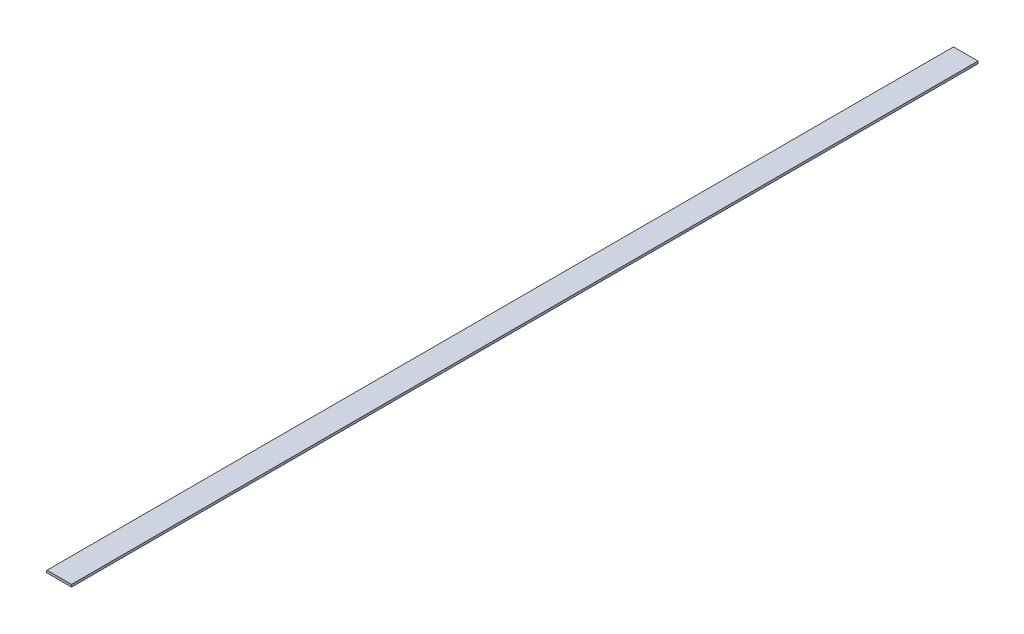
ISO-10303-21;
HEADER;
FILE_DESCRIPTION(('STEP AP214'),'2;1');
FILE_NAME('part.step','',(''),(''),'','','');
FILE_SCHEMA(('AUTOMOTIVE_DESIGN { 1 0 10303 214 1 1 1 1 }'));
ENDSEC;
DATA;
#1=APPLICATION_CONTEXT('core data for automotive mechanical design processes');
#2=APPLICATION_PROTOCOL_DEFINITION('international standard','automotive_design',2000,#1);
#3=PRODUCT_CONTEXT('',#1,'mechanical');
#4=PRODUCT('Part','Part','',(#3));
#5=PRODUCT_RELATED_PRODUCT_CATEGORY('part','',(#4));
#6=PRODUCT_DEFINITION_FORMATION('','',#4);
#7=PRODUCT_DEFINITION_CONTEXT('part definition',#1,'design');
#8=PRODUCT_DEFINITION('design','',#6,#7);
#9=PRODUCT_DEFINITION_SHAPE('','',#8);
#10=(LENGTH_UNIT() NAMED_UNIT(*) SI_UNIT(.MILLI.,.METRE.));
#11=(NAMED_UNIT(*) PLANE_ANGLE_UNIT() SI_UNIT($,.RADIAN.));
#12=(NAMED_UNIT(*) SI_UNIT($,.STERADIAN.) SOLID_ANGLE_UNIT());
#13=UNCERTAINTY_MEASURE_WITH_UNIT(LENGTH_MEASURE(1.E-05),#10,'distance_accuracy_value','');
#14=(GEOMETRIC_REPRESENTATION_CONTEXT(3) GLOBAL_UNCERTAINTY_ASSIGNED_CONTEXT((#13)) GLOBAL_UNIT_ASSIGNED_CONTEXT((#10,
#11,#12)) REPRESENTATION_CONTEXT('',''));
#15=CARTESIAN_POINT('',(0.,0.,0.));
#16=DIRECTION('',(0.,0.,1.));
#17=DIRECTION('',(1.,0.,0.));
#18=AXIS2_PLACEMENT_3D('',#15,#16,#17);
#19=CARTESIAN_POINT('',(0.97845527703774,2.3622,901.7));
#20=DIRECTION('',(0.923879532511285,-0.382683432365095,0.));
#21=DIRECTION('',(0.382683432365095,0.923879532511285,0.));
#22=AXIS2_PLACEMENT_3D('',#19,#20,#21);
#23=PLANE('',#22);
#24=DIRECTION('',(-0.382683432365095,-0.923879532511285,0.));
#25=VECTOR('',#24,1.);
#26=CARTESIAN_POINT('',(0.97845527703774,2.3622,0.));
#27=LINE('',#26,#25);
#28=CARTESIAN_POINT('',(0.97845527703774,2.3622,0.));
#29=VERTEX_POINT('',#28);
#30=CARTESIAN_POINT('',(0.,0.,0.));
#31=VERTEX_POINT('',#30);
#32=EDGE_CURVE('E98',#29,#31,#27,.T.);
#33=ORIENTED_EDGE('',*,*,#32,.T.);
#34=DIRECTION('',(0.,0.,-1.));
#35=VECTOR('',#34,1.);
#36=CARTESIAN_POINT('',(0.,0.,901.7));
#37=LINE('',#36,#35);
#38=CARTESIAN_POINT('',(0.,0.,901.7));
#39=VERTEX_POINT('',#38);
#40=EDGE_CURVE('E11',#39,#31,#37,.T.);
#41=ORIENTED_EDGE('',*,*,#40,.F.);
#42=DIRECTION('',(-0.382683432365095,-0.923879532511285,0.));
#43=VECTOR('',#42,1.);
#44=CARTESIAN_POINT('',(0.97845527703774,2.3622,901.7));
#45=LINE('',#44,#43);
#46=CARTESIAN_POINT('',(0.97845527703774,2.3622,901.7));
#47=VERTEX_POINT('',#46);
#48=EDGE_CURVE('E86',#47,#39,#45,.T.);
#49=ORIENTED_EDGE('',*,*,#48,.F.);
#50=DIRECTION('',(0.,0.,-1.));
#51=VECTOR('',#50,1.);
#52=CARTESIAN_POINT('',(0.97845527703774,2.3622,901.7));
#53=LINE('',#52,#51);
#54=EDGE_CURVE('E94',#47,#29,#53,.T.);
#55=ORIENTED_EDGE('',*,*,#54,.T.);
#56=EDGE_LOOP('',(#33,#41,#49,#55));
#57=FACE_BOUND('',#56,.T.);
#58=ADVANCED_FACE('F35',(#57),#23,.F.);
#59=CARTESIAN_POINT('',(0.,0.,901.7));
#60=DIRECTION('',(0.,1.,0.));
#61=DIRECTION('',(0.,0.,1.));
#62=AXIS2_PLACEMENT_3D('',#59,#60,#61);
#63=PLANE('',#62);
#64=DIRECTION('',(1.,0.,0.));
#65=VECTOR('',#64,1.);
#66=CARTESIAN_POINT('',(0.,0.,0.));
#67=LINE('',#66,#65);
#68=CARTESIAN_POINT('',(25.4,0.,0.));
#69=VERTEX_POINT('',#68);
#70=EDGE_CURVE('E90',#31,#69,#67,.T.);
#71=ORIENTED_EDGE('',*,*,#70,.T.);
#72=DIRECTION('',(0.,0.,-1.));
#73=VECTOR('',#72,1.);
#74=CARTESIAN_POINT('',(25.4,0.,901.7));
#75=LINE('',#74,#73);
#76=CARTESIAN_POINT('',(25.4,0.,901.7));
#77=VERTEX_POINT('',#76);
#78=EDGE_CURVE('E43',#77,#69,#75,.T.);
#79=ORIENTED_EDGE('',*,*,#78,.F.);
#80=DIRECTION('',(1.,0.,0.));
#81=VECTOR('',#80,1.);
#82=CARTESIAN_POINT('',(0.,0.,901.7));
#83=LINE('',#82,#81);
#84=EDGE_CURVE('E81',#39,#77,#83,.T.);
#85=ORIENTED_EDGE('',*,*,#84,.F.);
#86=ORIENTED_EDGE('',*,*,#40,.T.);
#87=EDGE_LOOP('',(#71,#79,#85,#86));
#88=FACE_BOUND('',#87,.T.);
#89=ADVANCED_FACE('F89',(#88),#63,.F.);
#90=CARTESIAN_POINT('',(25.4,0.,901.7));
#91=DIRECTION('',(-1.,0.,0.));
#92=DIRECTION('',(0.,0.,1.));
#93=AXIS2_PLACEMENT_3D('',#90,#91,#92);
#94=PLANE('',#93);
#95=DIRECTION('',(0.,1.,0.));
#96=VECTOR('',#95,1.);
#97=CARTESIAN_POINT('',(25.4,0.,0.));
#98=LINE('',#97,#96);
#99=CARTESIAN_POINT('',(25.4,2.3622,0.));
#100=VERTEX_POINT('',#99);
#101=EDGE_CURVE('E68',#69,#100,#98,.T.);
#102=ORIENTED_EDGE('',*,*,#101,.T.);
#103=DIRECTION('',(0.,0.,-1.));
#104=VECTOR('',#103,1.);
#105=CARTESIAN_POINT('',(25.4,2.3622,901.7));
#106=LINE('',#105,#104);
#107=CARTESIAN_POINT('',(25.4,2.3622,901.7));
#108=VERTEX_POINT('',#107);
#109=EDGE_CURVE('E91',#108,#100,#106,.T.);
#110=ORIENTED_EDGE('',*,*,#109,.F.);
#111=DIRECTION('',(0.,1.,0.));
#112=VECTOR('',#111,1.);
#113=CARTESIAN_POINT('',(25.4,0.,901.7));
#114=LINE('',#113,#112);
#115=EDGE_CURVE('E84',#77,#108,#114,.T.);
#116=ORIENTED_EDGE('',*,*,#115,.F.);
#117=ORIENTED_EDGE('',*,*,#78,.T.);
#118=EDGE_LOOP('',(#102,#110,#116,#117));
#119=FACE_BOUND('',#118,.T.);
#120=ADVANCED_FACE('F92',(#119),#94,.F.);
#121=CARTESIAN_POINT('',(25.4,2.3622,901.7));
#122=DIRECTION('',(0.,-1.,0.));
#123=DIRECTION('',(1.,0.,0.));
#124=AXIS2_PLACEMENT_3D('',#121,#122,#123);
#125=PLANE('',#124);
#126=DIRECTION('',(-1.,0.,0.));
#127=VECTOR('',#126,1.);
#128=CARTESIAN_POINT('',(25.4,2.3622,0.));
#129=LINE('',#128,#127);
#130=EDGE_CURVE('E74',#100,#29,#129,.T.);
#131=ORIENTED_EDGE('',*,*,#130,.T.);
#132=ORIENTED_EDGE('',*,*,#54,.F.);
#133=DIRECTION('',(-1.,0.,0.));
#134=VECTOR('',#133,1.);
#135=CARTESIAN_POINT('',(25.4,2.3622,901.7));
#136=LINE('',#135,#134);
#137=EDGE_CURVE('E51',#108,#47,#136,.T.);
#138=ORIENTED_EDGE('',*,*,#137,.F.);
#139=ORIENTED_EDGE('',*,*,#109,.T.);
#140=EDGE_LOOP('',(#131,#132,#138,#139));
#141=FACE_BOUND('',#140,.T.);
#142=ADVANCED_FACE('F105',(#141),#125,.F.);
#143=CARTESIAN_POINT('',(0.,0.,901.7));
#144=DIRECTION('',(0.,0.,1.));
#145=DIRECTION('',(1.,0.,0.));
#146=AXIS2_PLACEMENT_3D('',#143,#144,#145);
#147=PLANE('',#146);
#148=ORIENTED_EDGE('',*,*,#48,.T.);
#149=ORIENTED_EDGE('',*,*,#84,.T.);
#150=ORIENTED_EDGE('',*,*,#115,.T.);
#151=ORIENTED_EDGE('',*,*,#137,.T.);
#152=EDGE_LOOP('',(#148,#149,#150,#151));
#153=FACE_BOUND('',#152,.T.);
#154=ADVANCED_FACE('F82',(#153),#147,.T.);
#155=CARTESIAN_POINT('',(0.,0.,0.));
#156=DIRECTION('',(0.,0.,1.));
#157=DIRECTION('',(1.,0.,0.));
#158=AXIS2_PLACEMENT_3D('',#155,#156,#157);
#159=PLANE('',#158);
#160=ORIENTED_EDGE('',*,*,#32,.F.);
#161=ORIENTED_EDGE('',*,*,#130,.F.);
#162=ORIENTED_EDGE('',*,*,#101,.F.);
#163=ORIENTED_EDGE('',*,*,#70,.F.);
#164=EDGE_LOOP('',(#160,#161,#162,#163));
#165=FACE_BOUND('',#164,.T.);
#166=ADVANCED_FACE('F108',(#165),#159,.F.);
#167=CLOSED_SHELL('',(#58,#89,#120,#142,#154,#166));
#168=MANIFOLD_SOLID_BREP('B2',#167);
#169=ADVANCED_BREP_SHAPE_REPRESENTATION('',(#18,#168),#14);
#170=SHAPE_DEFINITION_REPRESENTATION(#9,#169);
ENDSEC;
END-ISO-10303-21;
